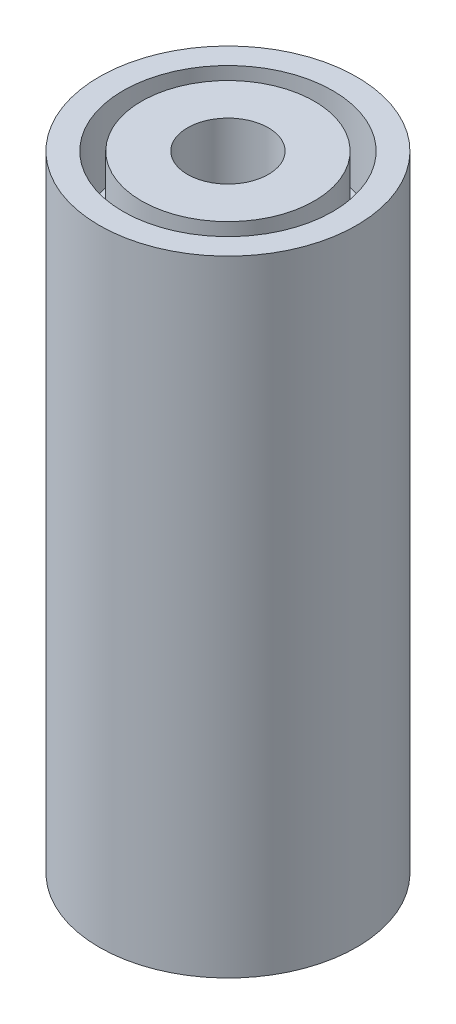
ISO-10303-21;
HEADER;
FILE_DESCRIPTION(('STEP AP214'),'2;1');
FILE_NAME('part.step','',(''),(''),'','','');
FILE_SCHEMA(('AUTOMOTIVE_DESIGN { 1 0 10303 214 1 1 1 1 }'));
ENDSEC;
DATA;
#1=APPLICATION_CONTEXT('core data for automotive mechanical design processes');
#2=APPLICATION_PROTOCOL_DEFINITION('international standard','automotive_design',2000,#1);
#3=PRODUCT_CONTEXT('',#1,'mechanical');
#4=PRODUCT('Part','Part','',(#3));
#5=PRODUCT_RELATED_PRODUCT_CATEGORY('part','',(#4));
#6=PRODUCT_DEFINITION_FORMATION('','',#4);
#7=PRODUCT_DEFINITION_CONTEXT('part definition',#1,'design');
#8=PRODUCT_DEFINITION('design','',#6,#7);
#9=PRODUCT_DEFINITION_SHAPE('','',#8);
#10=(LENGTH_UNIT() NAMED_UNIT(*) SI_UNIT(.MILLI.,.METRE.));
#11=(NAMED_UNIT(*) PLANE_ANGLE_UNIT() SI_UNIT($,.RADIAN.));
#12=(NAMED_UNIT(*) SI_UNIT($,.STERADIAN.) SOLID_ANGLE_UNIT());
#13=UNCERTAINTY_MEASURE_WITH_UNIT(LENGTH_MEASURE(1.E-05),#10,'distance_accuracy_value','');
#14=(GEOMETRIC_REPRESENTATION_CONTEXT(3) GLOBAL_UNCERTAINTY_ASSIGNED_CONTEXT((#13)) GLOBAL_UNIT_ASSIGNED_CONTEXT((#10,
#11,#12)) REPRESENTATION_CONTEXT('',''));
#15=CARTESIAN_POINT('',(0.,0.,0.));
#16=DIRECTION('',(0.,0.,1.));
#17=DIRECTION('',(1.,0.,0.));
#18=AXIS2_PLACEMENT_3D('',#15,#16,#17);
#19=CARTESIAN_POINT('',(0.,17.,0.));
#20=DIRECTION('',(0.,1.,0.));
#21=DIRECTION('',(0.,0.,1.));
#22=AXIS2_PLACEMENT_3D('',#19,#20,#21);
#23=PLANE('',#22);
#24=CARTESIAN_POINT('',(0.,17.,0.));
#25=DIRECTION('',(0.,1.,0.));
#26=DIRECTION('',(0.,0.,1.));
#27=AXIS2_PLACEMENT_3D('',#24,#25,#26);
#28=CIRCLE('',#27,1.1);
#29=CARTESIAN_POINT('',(0.,17.,1.1));
#30=VERTEX_POINT('',#29);
#31=EDGE_CURVE('E41',#30,#30,#28,.T.);
#32=ORIENTED_EDGE('',*,*,#31,.F.);
#33=EDGE_LOOP('',(#32));
#34=FACE_BOUND('',#33,.T.);
#35=CARTESIAN_POINT('',(0.,17.,0.));
#36=DIRECTION('',(0.,1.,0.));
#37=DIRECTION('',(0.,0.,1.));
#38=AXIS2_PLACEMENT_3D('',#35,#36,#37);
#39=CIRCLE('',#38,2.35);
#40=CARTESIAN_POINT('',(0.,17.,2.35));
#41=VERTEX_POINT('',#40);
#42=EDGE_CURVE('E55',#41,#41,#39,.T.);
#43=ORIENTED_EDGE('',*,*,#42,.T.);
#44=EDGE_LOOP('',(#43));
#45=FACE_BOUND('',#44,.T.);
#46=ADVANCED_FACE('F30',(#34,#45),#23,.T.);
#47=CARTESIAN_POINT('',(0.,17.,0.));
#48=DIRECTION('',(0.,1.,0.));
#49=DIRECTION('',(0.,0.,1.));
#50=AXIS2_PLACEMENT_3D('',#47,#48,#49);
#51=CIRCLE('',#50,2.85);
#52=CARTESIAN_POINT('',(0.,17.,2.85));
#53=VERTEX_POINT('',#52);
#54=EDGE_CURVE('E49',#53,#53,#51,.T.);
#55=ORIENTED_EDGE('',*,*,#54,.F.);
#56=EDGE_LOOP('',(#55));
#57=FACE_BOUND('',#56,.T.);
#58=CARTESIAN_POINT('',(0.,17.,0.));
#59=DIRECTION('',(0.,1.,0.));
#60=DIRECTION('',(0.,0.,1.));
#61=AXIS2_PLACEMENT_3D('',#58,#59,#60);
#62=CIRCLE('',#61,3.5);
#63=CARTESIAN_POINT('',(0.,17.,3.5));
#64=VERTEX_POINT('',#63);
#65=EDGE_CURVE('E10',#64,#64,#62,.T.);
#66=ORIENTED_EDGE('',*,*,#65,.T.);
#67=EDGE_LOOP('',(#66));
#68=FACE_BOUND('',#67,.T.);
#69=ADVANCED_FACE('F77',(#57,#68),#23,.T.);
#70=CARTESIAN_POINT('',(0.,0.,0.));
#71=DIRECTION('',(0.,1.,0.));
#72=DIRECTION('',(0.,0.,1.));
#73=AXIS2_PLACEMENT_3D('',#70,#71,#72);
#74=PLANE('',#73);
#75=CARTESIAN_POINT('',(0.,0.,0.));
#76=DIRECTION('',(0.,1.,0.));
#77=DIRECTION('',(0.,0.,1.));
#78=AXIS2_PLACEMENT_3D('',#75,#76,#77);
#79=CIRCLE('',#78,3.5);
#80=CARTESIAN_POINT('',(0.,0.,3.5));
#81=VERTEX_POINT('',#80);
#82=EDGE_CURVE('E34',#81,#81,#79,.T.);
#83=ORIENTED_EDGE('',*,*,#82,.F.);
#84=EDGE_LOOP('',(#83));
#85=FACE_BOUND('',#84,.T.);
#86=CARTESIAN_POINT('',(0.,0.,0.));
#87=DIRECTION('',(0.,1.,0.));
#88=DIRECTION('',(0.,0.,1.));
#89=AXIS2_PLACEMENT_3D('',#86,#87,#88);
#90=CIRCLE('',#89,1.1);
#91=CARTESIAN_POINT('',(0.,0.,1.1));
#92=VERTEX_POINT('',#91);
#93=EDGE_CURVE('E43',#92,#92,#90,.T.);
#94=ORIENTED_EDGE('',*,*,#93,.T.);
#95=EDGE_LOOP('',(#94));
#96=FACE_BOUND('',#95,.T.);
#97=ADVANCED_FACE('F79',(#85,#96),#74,.F.);
#98=CARTESIAN_POINT('',(0.,17.,0.));
#99=DIRECTION('',(0.,-1.,0.));
#100=DIRECTION('',(0.,0.,-1.));
#101=AXIS2_PLACEMENT_3D('',#98,#99,#100);
#102=CYLINDRICAL_SURFACE('',#101,3.5);
#103=ORIENTED_EDGE('',*,*,#65,.F.);
#104=EDGE_LOOP('',(#103));
#105=FACE_BOUND('',#104,.T.);
#106=ORIENTED_EDGE('',*,*,#82,.T.);
#107=EDGE_LOOP('',(#106));
#108=FACE_BOUND('',#107,.T.);
#109=ADVANCED_FACE('F32',(#105,#108),#102,.T.);
#110=CARTESIAN_POINT('',(0.,17.,0.));
#111=DIRECTION('',(0.,-1.,0.));
#112=DIRECTION('',(0.,0.,-1.));
#113=AXIS2_PLACEMENT_3D('',#110,#111,#112);
#114=CYLINDRICAL_SURFACE('',#113,1.1);
#115=ORIENTED_EDGE('',*,*,#31,.T.);
#116=EDGE_LOOP('',(#115));
#117=FACE_BOUND('',#116,.T.);
#118=ORIENTED_EDGE('',*,*,#93,.F.);
#119=EDGE_LOOP('',(#118));
#120=FACE_BOUND('',#119,.T.);
#121=ADVANCED_FACE('F73',(#117,#120),#114,.F.);
#122=CARTESIAN_POINT('',(0.,15.,0.));
#123=DIRECTION('',(0.,1.,0.));
#124=DIRECTION('',(0.,0.,1.));
#125=AXIS2_PLACEMENT_3D('',#122,#123,#124);
#126=CYLINDRICAL_SURFACE('',#125,2.85);
#127=CARTESIAN_POINT('',(0.,15.,0.));
#128=DIRECTION('',(0.,1.,0.));
#129=DIRECTION('',(0.,0.,1.));
#130=AXIS2_PLACEMENT_3D('',#127,#128,#129);
#131=CIRCLE('',#130,2.85);
#132=CARTESIAN_POINT('',(0.,15.,2.85));
#133=VERTEX_POINT('',#132);
#134=EDGE_CURVE('E46',#133,#133,#131,.T.);
#135=ORIENTED_EDGE('',*,*,#134,.F.);
#136=EDGE_LOOP('',(#135));
#137=FACE_BOUND('',#136,.T.);
#138=ORIENTED_EDGE('',*,*,#54,.T.);
#139=EDGE_LOOP('',(#138));
#140=FACE_BOUND('',#139,.T.);
#141=ADVANCED_FACE('F67',(#137,#140),#126,.F.);
#142=CARTESIAN_POINT('',(0.,15.,0.));
#143=DIRECTION('',(0.,1.,0.));
#144=DIRECTION('',(0.,0.,1.));
#145=AXIS2_PLACEMENT_3D('',#142,#143,#144);
#146=PLANE('',#145);
#147=CARTESIAN_POINT('',(0.,15.,0.));
#148=DIRECTION('',(0.,1.,0.));
#149=DIRECTION('',(0.,0.,1.));
#150=AXIS2_PLACEMENT_3D('',#147,#148,#149);
#151=CIRCLE('',#150,2.35);
#152=CARTESIAN_POINT('',(0.,15.,2.35));
#153=VERTEX_POINT('',#152);
#154=EDGE_CURVE('E52',#153,#153,#151,.T.);
#155=ORIENTED_EDGE('',*,*,#154,.F.);
#156=EDGE_LOOP('',(#155));
#157=FACE_BOUND('',#156,.T.);
#158=ORIENTED_EDGE('',*,*,#134,.T.);
#159=EDGE_LOOP('',(#158));
#160=FACE_BOUND('',#159,.T.);
#161=ADVANCED_FACE('F64',(#157,#160),#146,.T.);
#162=CARTESIAN_POINT('',(0.,15.,0.));
#163=DIRECTION('',(0.,1.,0.));
#164=DIRECTION('',(0.,0.,1.));
#165=AXIS2_PLACEMENT_3D('',#162,#163,#164);
#166=CYLINDRICAL_SURFACE('',#165,2.35);
#167=ORIENTED_EDGE('',*,*,#154,.T.);
#168=EDGE_LOOP('',(#167));
#169=FACE_BOUND('',#168,.T.);
#170=ORIENTED_EDGE('',*,*,#42,.F.);
#171=EDGE_LOOP('',(#170));
#172=FACE_BOUND('',#171,.T.);
#173=ADVANCED_FACE('F61',(#169,#172),#166,.T.);
#174=CLOSED_SHELL('',(#46,#69,#97,#109,#121,#141,#161,#173));
#175=MANIFOLD_SOLID_BREP('B2',#174);
#176=ADVANCED_BREP_SHAPE_REPRESENTATION('',(#18,#175),#14);
#177=SHAPE_DEFINITION_REPRESENTATION(#9,#176);
ENDSEC;
END-ISO-10303-21;
